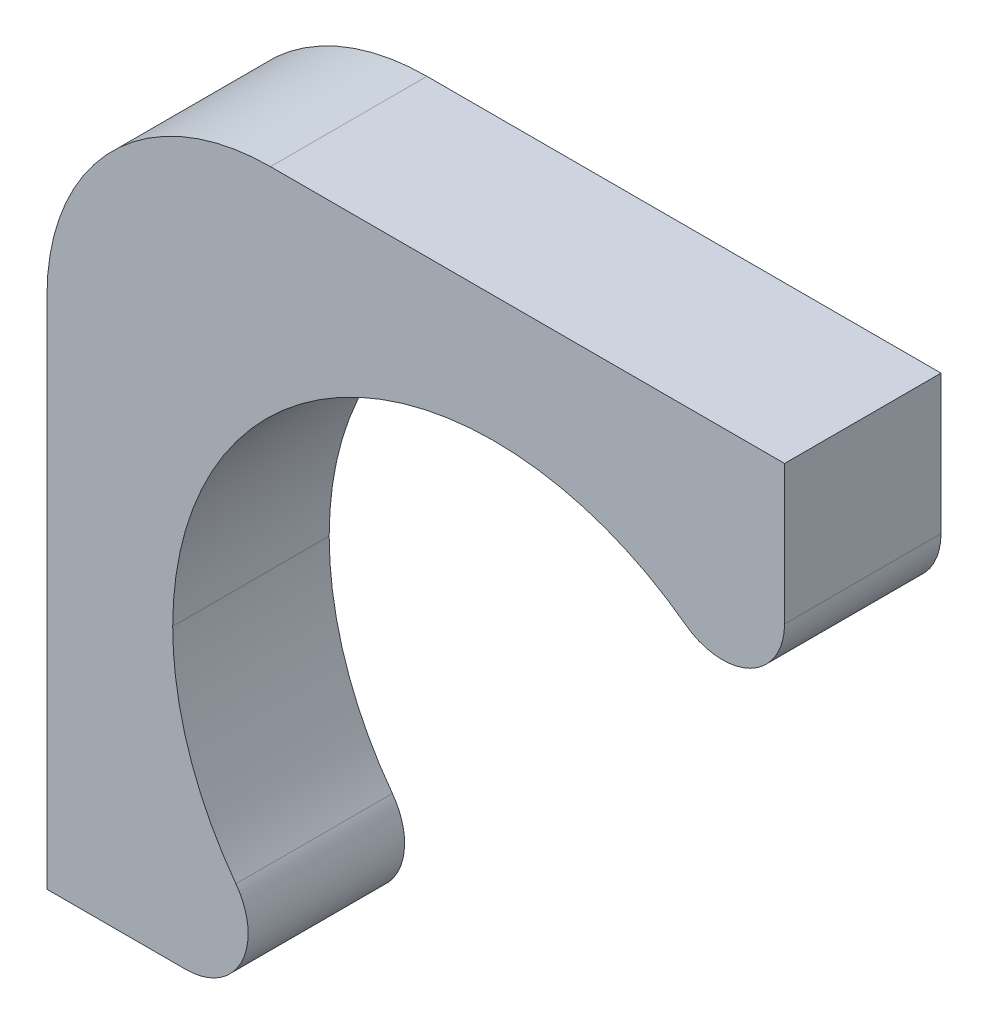
ISO-10303-21;
HEADER;
FILE_DESCRIPTION(('STEP AP214'),'2;1');
FILE_NAME('part.step','',(''),(''),'','','');
FILE_SCHEMA(('AUTOMOTIVE_DESIGN { 1 0 10303 214 1 1 1 1 }'));
ENDSEC;
DATA;
#1=APPLICATION_CONTEXT('core data for automotive mechanical design processes');
#2=APPLICATION_PROTOCOL_DEFINITION('international standard','automotive_design',2000,#1);
#3=PRODUCT_CONTEXT('',#1,'mechanical');
#4=PRODUCT('Part','Part','',(#3));
#5=PRODUCT_RELATED_PRODUCT_CATEGORY('part','',(#4));
#6=PRODUCT_DEFINITION_FORMATION('','',#4);
#7=PRODUCT_DEFINITION_CONTEXT('part definition',#1,'design');
#8=PRODUCT_DEFINITION('design','',#6,#7);
#9=PRODUCT_DEFINITION_SHAPE('','',#8);
#10=(LENGTH_UNIT() NAMED_UNIT(*) SI_UNIT(.MILLI.,.METRE.));
#11=(NAMED_UNIT(*) PLANE_ANGLE_UNIT() SI_UNIT($,.RADIAN.));
#12=(NAMED_UNIT(*) SI_UNIT($,.STERADIAN.) SOLID_ANGLE_UNIT());
#13=UNCERTAINTY_MEASURE_WITH_UNIT(LENGTH_MEASURE(1.E-05),#10,'distance_accuracy_value','');
#14=(GEOMETRIC_REPRESENTATION_CONTEXT(3) GLOBAL_UNCERTAINTY_ASSIGNED_CONTEXT((#13)) GLOBAL_UNIT_ASSIGNED_CONTEXT((#10,
#11,#12)) REPRESENTATION_CONTEXT('',''));
#15=CARTESIAN_POINT('',(0.,0.,0.));
#16=DIRECTION('',(0.,0.,1.));
#17=DIRECTION('',(1.,0.,0.));
#18=AXIS2_PLACEMENT_3D('',#15,#16,#17);
#19=CARTESIAN_POINT('',(-2.75631465594,-2.04368534406,0.));
#20=DIRECTION('',(0.,0.,1.));
#21=DIRECTION('',(1.,0.,0.));
#22=AXIS2_PLACEMENT_3D('',#19,#20,#21);
#23=PLANE('',#22);
#24=CARTESIAN_POINT('',(-2.75631465594,-2.04368534406,0.));
#25=DIRECTION('',(0.,0.,1.));
#26=DIRECTION('',(1.,0.,0.));
#27=AXIS2_PLACEMENT_3D('',#24,#25,#26);
#28=CIRCLE('',#27,0.556314655941);
#29=CARTESIAN_POINT('',(-2.20000000062,-2.04368534406,0.));
#30=VERTEX_POINT('',#29);
#31=CARTESIAN_POINT('',(-2.30943688582,-1.71234525276,0.));
#32=VERTEX_POINT('',#31);
#33=EDGE_CURVE('E162',#30,#32,#28,.T.);
#34=ORIENTED_EDGE('',*,*,#33,.F.);
#35=CARTESIAN_POINT('',(-2.75631465594,-2.04368534406,-3.72529914902109E-10));
#36=DIRECTION('',(0.,0.,1.));
#37=DIRECTION('',(0.,-1.,0.));
#38=AXIS2_PLACEMENT_3D('',#35,#36,#37);
#39=CIRCLE('',#38,0.556314655941);
#40=CARTESIAN_POINT('',(-2.75631465594,-2.60000000057,0.));
#41=VERTEX_POINT('',#40);
#42=EDGE_CURVE('E116',#41,#30,#39,.T.);
#43=ORIENTED_EDGE('',*,*,#42,.F.);
#44=DIRECTION('',(1.,0.,0.));
#45=VECTOR('',#44,1.);
#46=CARTESIAN_POINT('',(-3.37815732788,-2.6,-3.72529118664E-10));
#47=LINE('',#46,#45);
#48=CARTESIAN_POINT('',(-4.,-2.59999999963,-3.72529118664E-10));
#49=VERTEX_POINT('',#48);
#50=EDGE_CURVE('E208',#49,#41,#47,.T.);
#51=ORIENTED_EDGE('',*,*,#50,.F.);
#52=DIRECTION('',(0.,-1.,0.));
#53=VECTOR('',#52,1.);
#54=CARTESIAN_POINT('',(-4.,-0.299999999814,-3.72529118664E-10));
#55=LINE('',#54,#53);
#56=CARTESIAN_POINT('',(-4.,2.,-3.72529118664E-10));
#57=VERTEX_POINT('',#56);
#58=EDGE_CURVE('E129',#57,#49,#55,.T.);
#59=ORIENTED_EDGE('',*,*,#58,.F.);
#60=CARTESIAN_POINT('',(-2.,2.,-3.72529118664E-10));
#61=DIRECTION('',(0.,0.,1.));
#62=DIRECTION('',(1.,0.,0.));
#63=AXIS2_PLACEMENT_3D('',#60,#61,#62);
#64=CIRCLE('',#63,2.);
#65=CARTESIAN_POINT('',(-1.99999999963,4.,-3.72529118664E-10));
#66=VERTEX_POINT('',#65);
#67=EDGE_CURVE('E120',#66,#57,#64,.T.);
#68=ORIENTED_EDGE('',*,*,#67,.F.);
#69=DIRECTION('',(-1.,0.,0.));
#70=VECTOR('',#69,1.);
#71=CARTESIAN_POINT('',(0.300000000186,4.,-3.72529118664E-10));
#72=LINE('',#71,#70);
#73=CARTESIAN_POINT('',(2.6,4.,-3.72529118664E-10));
#74=VERTEX_POINT('',#73);
#75=EDGE_CURVE('E106',#74,#66,#72,.T.);
#76=ORIENTED_EDGE('',*,*,#75,.F.);
#77=DIRECTION('',(0.,1.,0.));
#78=VECTOR('',#77,1.);
#79=CARTESIAN_POINT('',(2.6,3.37815732788,-3.72529118664E-10));
#80=LINE('',#79,#78);
#81=CARTESIAN_POINT('',(2.59999999945,2.75631465669,0.));
#82=VERTEX_POINT('',#81);
#83=EDGE_CURVE('E96',#82,#74,#80,.T.);
#84=ORIENTED_EDGE('',*,*,#83,.F.);
#85=CARTESIAN_POINT('',(2.04368534406,2.75631465594,-3.72529914902109E-10));
#86=DIRECTION('',(0.,0.,1.));
#87=DIRECTION('',(-0.595598349027393,-0.803282395322992,0.));
#88=AXIS2_PLACEMENT_3D('',#85,#86,#87);
#89=CIRCLE('',#88,0.556314655941);
#90=CARTESIAN_POINT('',(1.71234525344,2.30943688656,-3.72529118664E-10));
#91=VERTEX_POINT('',#90);
#92=EDGE_CURVE('E87',#91,#82,#89,.T.);
#93=ORIENTED_EDGE('',*,*,#92,.F.);
#94=CARTESIAN_POINT('',(0.,0.,-3.72529118664E-10));
#95=DIRECTION('',(0.,0.,-1.));
#96=DIRECTION('',(1.,0.,0.));
#97=AXIS2_PLACEMENT_3D('',#94,#95,#96);
#98=CIRCLE('',#97,2.875);
#99=CARTESIAN_POINT('',(-2.875,0.,-3.72529118664E-10));
#100=VERTEX_POINT('',#99);
#101=EDGE_CURVE('E311',#100,#91,#98,.T.);
#102=ORIENTED_EDGE('',*,*,#101,.F.);
#103=CARTESIAN_POINT('',(0.,0.,-3.72529118664E-10));
#104=DIRECTION('',(0.,0.,-1.));
#105=DIRECTION('',(1.,0.,0.));
#106=AXIS2_PLACEMENT_3D('',#103,#104,#105);
#107=CIRCLE('',#106,2.875);
#108=EDGE_CURVE('E11',#32,#100,#107,.T.);
#109=ORIENTED_EDGE('',*,*,#108,.F.);
#110=EDGE_LOOP('',(#34,#43,#51,#59,#68,#76,#84,#93,#102,#109));
#111=FACE_BOUND('',#110,.T.);
#112=ADVANCED_FACE('F17',(#111),#23,.F.);
#113=CARTESIAN_POINT('',(0.,0.,1.4));
#114=DIRECTION('',(0.,0.,-1.));
#115=DIRECTION('',(-1.,0.,0.));
#116=AXIS2_PLACEMENT_3D('',#113,#114,#115);
#117=CYLINDRICAL_SURFACE('',#116,2.875);
#118=DIRECTION('',(0.,0.,-1.));
#119=VECTOR('',#118,1.);
#120=CARTESIAN_POINT('',(-2.875,0.,1.40000000037));
#121=LINE('',#120,#119);
#122=CARTESIAN_POINT('',(-2.875,0.,1.4));
#123=VERTEX_POINT('',#122);
#124=EDGE_CURVE('E156',#123,#100,#121,.T.);
#125=ORIENTED_EDGE('',*,*,#124,.F.);
#126=CARTESIAN_POINT('',(-2.30943688582,-1.71234525276,1.4));
#127=CARTESIAN_POINT('',(-2.48423375655,-1.47659703544,1.4));
#128=CARTESIAN_POINT('',(-2.62894876564,-1.21854502221,1.4));
#129=CARTESIAN_POINT('',(-2.73978751086,-0.943286310535,1.4));
#130=CARTESIAN_POINT('',(-2.83289541122,-0.58539717655,1.4));
#131=CARTESIAN_POINT('',(-2.86797349989,-0.220063592055,1.4));
#132=CARTESIAN_POINT('',(-2.87266100848,-0.146692643978,1.4));
#133=CARTESIAN_POINT('',(-2.87500000018,-0.0733463071471,1.4));
#134=CARTESIAN_POINT('',(-2.87500000018,9.20388210091E-10,1.4));
#135=(BOUNDED_CURVE() B_SPLINE_CURVE(5,(#126,#127,#128,#129,#130,#131,#132,#133,#134),
.UNSPECIFIED.,.F.,.F.) B_SPLINE_CURVE_WITH_KNOTS((6,3,6),(0.,2.0752249033,2.5938616214),
.UNSPECIFIED.) CURVE() GEOMETRIC_REPRESENTATION_ITEM() RATIONAL_B_SPLINE_CURVE((1.,1.,1.,1.,1.,
1.,1.,1.,1.)) REPRESENTATION_ITEM(''));
#136=CARTESIAN_POINT('',(-2.30943688656,-1.71234525344,1.4));
#137=VERTEX_POINT('',#136);
#138=EDGE_CURVE('E144',#137,#123,#135,.T.);
#139=ORIENTED_EDGE('',*,*,#138,.F.);
#140=DIRECTION('',(0.,0.,-1.));
#141=VECTOR('',#140,1.);
#142=CARTESIAN_POINT('',(-2.30943688656,-1.71234525344,1.40000000037));
#143=LINE('',#142,#141);
#144=EDGE_CURVE('E28',#137,#32,#143,.T.);
#145=ORIENTED_EDGE('',*,*,#144,.T.);
#146=ORIENTED_EDGE('',*,*,#108,.T.);
#147=EDGE_LOOP('',(#125,#139,#145,#146));
#148=FACE_BOUND('',#147,.T.);
#149=ADVANCED_FACE('F178',(#148),#117,.F.);
#150=CARTESIAN_POINT('',(-2.75631465594,-2.04368534406,1.4));
#151=DIRECTION('',(0.,0.,-1.));
#152=DIRECTION('',(1.,0.,0.));
#153=AXIS2_PLACEMENT_3D('',#150,#151,#152);
#154=CYLINDRICAL_SURFACE('',#153,0.556314655941);
#155=CARTESIAN_POINT('',(-2.7563146589,-2.0436853423,1.4));
#156=DIRECTION('',(0.,0.,1.));
#157=DIRECTION('',(1.,0.,0.));
#158=AXIS2_PLACEMENT_3D('',#155,#156,#157);
#159=CIRCLE('',#158,0.556314658274);
#160=CARTESIAN_POINT('',(-2.75631465594,-2.6,1.4));
#161=VERTEX_POINT('',#160);
#162=CARTESIAN_POINT('',(-2.20000000062,-2.04368534406,1.4));
#163=VERTEX_POINT('',#162);
#164=EDGE_CURVE('E145',#161,#163,#159,.T.);
#165=ORIENTED_EDGE('',*,*,#164,.F.);
#166=DIRECTION('',(0.,0.,-1.));
#167=VECTOR('',#166,1.);
#168=CARTESIAN_POINT('',(-2.75631465577,-2.6,0.699999999814));
#169=LINE('',#168,#167);
#170=EDGE_CURVE('E200',#161,#41,#169,.T.);
#171=ORIENTED_EDGE('',*,*,#170,.T.);
#172=ORIENTED_EDGE('',*,*,#42,.T.);
#173=ORIENTED_EDGE('',*,*,#33,.T.);
#174=ORIENTED_EDGE('',*,*,#144,.F.);
#175=CARTESIAN_POINT('',(-2.7563146589,-2.0436853423,1.4));
#176=DIRECTION('',(0.,0.,1.));
#177=DIRECTION('',(1.,0.,0.));
#178=AXIS2_PLACEMENT_3D('',#175,#176,#177);
#179=CIRCLE('',#178,0.556314658274);
#180=EDGE_CURVE('E141',#163,#137,#179,.T.);
#181=ORIENTED_EDGE('',*,*,#180,.F.);
#182=EDGE_LOOP('',(#165,#171,#172,#173,#174,#181));
#183=FACE_BOUND('',#182,.T.);
#184=ADVANCED_FACE('F168',(#183),#154,.T.);
#185=CARTESIAN_POINT('',(2.6,4.,1.4));
#186=DIRECTION('',(0.,-1.,0.));
#187=DIRECTION('',(0.,0.,-1.));
#188=AXIS2_PLACEMENT_3D('',#185,#186,#187);
#189=PLANE('',#188);
#190=ORIENTED_EDGE('',*,*,#75,.T.);
#191=DIRECTION('',(0.,0.,-1.));
#192=VECTOR('',#191,1.);
#193=CARTESIAN_POINT('',(-2.,4.,1.40000000037));
#194=LINE('',#193,#192);
#195=CARTESIAN_POINT('',(-1.99999999963,4.,1.4));
#196=VERTEX_POINT('',#195);
#197=EDGE_CURVE('E110',#196,#66,#194,.T.);
#198=ORIENTED_EDGE('',*,*,#197,.F.);
#199=DIRECTION('',(-1.,0.,0.));
#200=VECTOR('',#199,1.);
#201=CARTESIAN_POINT('',(0.299999999638,4.00000000092,1.4));
#202=LINE('',#201,#200);
#203=CARTESIAN_POINT('',(2.6,4.,1.4));
#204=VERTEX_POINT('',#203);
#205=EDGE_CURVE('E151',#204,#196,#202,.T.);
#206=ORIENTED_EDGE('',*,*,#205,.F.);
#207=DIRECTION('',(0.,0.,-1.));
#208=VECTOR('',#207,1.);
#209=CARTESIAN_POINT('',(2.6,4.,0.699999999814));
#210=LINE('',#209,#208);
#211=EDGE_CURVE('E113',#204,#74,#210,.T.);
#212=ORIENTED_EDGE('',*,*,#211,.T.);
#213=EDGE_LOOP('',(#190,#198,#206,#212));
#214=FACE_BOUND('',#213,.T.);
#215=ADVANCED_FACE('F108',(#214),#189,.F.);
#216=CARTESIAN_POINT('',(-2.,2.,1.4));
#217=DIRECTION('',(0.,0.,-1.));
#218=DIRECTION('',(-1.,0.,0.));
#219=AXIS2_PLACEMENT_3D('',#216,#217,#218);
#220=CYLINDRICAL_SURFACE('',#219,2.);
#221=ORIENTED_EDGE('',*,*,#67,.T.);
#222=DIRECTION('',(0.,0.,-1.));
#223=VECTOR('',#222,1.);
#224=CARTESIAN_POINT('',(-4.,2.,0.699999999814));
#225=LINE('',#224,#223);
#226=CARTESIAN_POINT('',(-4.,2.,1.4));
#227=VERTEX_POINT('',#226);
#228=EDGE_CURVE('E131',#227,#57,#225,.T.);
#229=ORIENTED_EDGE('',*,*,#228,.F.);
#230=CARTESIAN_POINT('',(-1.99999999703,1.99999999778,1.4));
#231=DIRECTION('',(0.,0.,1.));
#232=DIRECTION('',(1.,0.,0.));
#233=AXIS2_PLACEMENT_3D('',#230,#231,#232);
#234=CIRCLE('',#233,2.00000000314);
#235=EDGE_CURVE('E123',#196,#227,#234,.T.);
#236=ORIENTED_EDGE('',*,*,#235,.F.);
#237=ORIENTED_EDGE('',*,*,#197,.T.);
#238=EDGE_LOOP('',(#221,#229,#236,#237));
#239=FACE_BOUND('',#238,.T.);
#240=ADVANCED_FACE('F119',(#239),#220,.T.);
#241=CARTESIAN_POINT('',(-4.,2.,1.4));
#242=DIRECTION('',(1.,0.,0.));
#243=DIRECTION('',(0.,1.,0.));
#244=AXIS2_PLACEMENT_3D('',#241,#242,#243);
#245=PLANE('',#244);
#246=ORIENTED_EDGE('',*,*,#58,.T.);
#247=DIRECTION('',(0.,0.,-1.));
#248=VECTOR('',#247,1.);
#249=CARTESIAN_POINT('',(-4.,-2.6,0.699999999814));
#250=LINE('',#249,#248);
#251=CARTESIAN_POINT('',(-4.,-2.59999999963,1.4));
#252=VERTEX_POINT('',#251);
#253=EDGE_CURVE('E140',#252,#49,#250,.T.);
#254=ORIENTED_EDGE('',*,*,#253,.F.);
#255=DIRECTION('',(0.,-1.,0.));
#256=VECTOR('',#255,1.);
#257=CARTESIAN_POINT('',(-4.00000000018,-0.299999999825,1.4));
#258=LINE('',#257,#256);
#259=EDGE_CURVE('E150',#227,#252,#258,.T.);
#260=ORIENTED_EDGE('',*,*,#259,.F.);
#261=ORIENTED_EDGE('',*,*,#228,.T.);
#262=EDGE_LOOP('',(#246,#254,#260,#261));
#263=FACE_BOUND('',#262,.T.);
#264=ADVANCED_FACE('F179',(#263),#245,.F.);
#265=CARTESIAN_POINT('',(-4.,-2.6,1.4));
#266=DIRECTION('',(0.,1.,0.));
#267=DIRECTION('',(1.,0.,0.));
#268=AXIS2_PLACEMENT_3D('',#265,#266,#267);
#269=PLANE('',#268);
#270=ORIENTED_EDGE('',*,*,#50,.T.);
#271=ORIENTED_EDGE('',*,*,#170,.F.);
#272=DIRECTION('',(1.,0.,0.));
#273=VECTOR('',#272,1.);
#274=CARTESIAN_POINT('',(-3.37815732806,-2.60000000057,1.4));
#275=LINE('',#274,#273);
#276=EDGE_CURVE('E304',#252,#161,#275,.T.);
#277=ORIENTED_EDGE('',*,*,#276,.F.);
#278=ORIENTED_EDGE('',*,*,#253,.T.);
#279=EDGE_LOOP('',(#270,#271,#277,#278));
#280=FACE_BOUND('',#279,.T.);
#281=ADVANCED_FACE('F234',(#280),#269,.F.);
#282=CARTESIAN_POINT('',(2.6,4.,1.4));
#283=DIRECTION('',(-1.,0.,0.));
#284=DIRECTION('',(0.,0.,1.));
#285=AXIS2_PLACEMENT_3D('',#282,#283,#284);
#286=PLANE('',#285);
#287=ORIENTED_EDGE('',*,*,#83,.T.);
#288=ORIENTED_EDGE('',*,*,#211,.F.);
#289=DIRECTION('',(0.,1.,0.));
#290=VECTOR('',#289,1.);
#291=CARTESIAN_POINT('',(2.59999999945,3.3781573288,1.4));
#292=LINE('',#291,#290);
#293=CARTESIAN_POINT('',(2.6,2.75631465594,1.4));
#294=VERTEX_POINT('',#293);
#295=EDGE_CURVE('E291',#294,#204,#292,.T.);
#296=ORIENTED_EDGE('',*,*,#295,.F.);
#297=DIRECTION('',(0.,0.,-1.));
#298=VECTOR('',#297,1.);
#299=CARTESIAN_POINT('',(2.6,2.75631465594,1.40000000037));
#300=LINE('',#299,#298);
#301=EDGE_CURVE('E314',#294,#82,#300,.T.);
#302=ORIENTED_EDGE('',*,*,#301,.T.);
#303=EDGE_LOOP('',(#287,#288,#296,#302));
#304=FACE_BOUND('',#303,.T.);
#305=ADVANCED_FACE('F236',(#304),#286,.F.);
#306=CARTESIAN_POINT('',(-2.75631465594,-2.04368534406,1.4));
#307=DIRECTION('',(0.,0.,1.));
#308=DIRECTION('',(1.,0.,0.));
#309=AXIS2_PLACEMENT_3D('',#306,#307,#308);
#310=PLANE('',#309);
#311=ORIENTED_EDGE('',*,*,#164,.T.);
#312=ORIENTED_EDGE('',*,*,#180,.T.);
#313=ORIENTED_EDGE('',*,*,#138,.T.);
#314=CARTESIAN_POINT('',(0.,0.,1.4));
#315=DIRECTION('',(0.,0.,-1.));
#316=DIRECTION('',(1.,0.,0.));
#317=AXIS2_PLACEMENT_3D('',#314,#315,#316);
#318=CIRCLE('',#317,2.875);
#319=CARTESIAN_POINT('',(1.71234525344,2.30943688656,1.4));
#320=VERTEX_POINT('',#319);
#321=EDGE_CURVE('E152',#123,#320,#318,.T.);
#322=ORIENTED_EDGE('',*,*,#321,.T.);
#323=CARTESIAN_POINT('',(2.04368534406,2.75631465594,1.4));
#324=DIRECTION('',(0.,0.,1.));
#325=DIRECTION('',(1.,0.,0.));
#326=AXIS2_PLACEMENT_3D('',#323,#324,#325);
#327=CIRCLE('',#326,0.556314655941);
#328=EDGE_CURVE('E273',#320,#294,#327,.T.);
#329=ORIENTED_EDGE('',*,*,#328,.T.);
#330=ORIENTED_EDGE('',*,*,#295,.T.);
#331=ORIENTED_EDGE('',*,*,#205,.T.);
#332=ORIENTED_EDGE('',*,*,#235,.T.);
#333=ORIENTED_EDGE('',*,*,#259,.T.);
#334=ORIENTED_EDGE('',*,*,#276,.T.);
#335=EDGE_LOOP('',(#311,#312,#313,#322,#329,#330,#331,#332,#333,#334));
#336=FACE_BOUND('',#335,.T.);
#337=ADVANCED_FACE('F233',(#336),#310,.T.);
#338=CARTESIAN_POINT('',(2.04368534406,2.75631465594,1.4));
#339=DIRECTION('',(0.,0.,-1.));
#340=DIRECTION('',(1.,0.,0.));
#341=AXIS2_PLACEMENT_3D('',#338,#339,#340);
#342=CYLINDRICAL_SURFACE('',#341,0.556314655941);
#343=ORIENTED_EDGE('',*,*,#92,.T.);
#344=ORIENTED_EDGE('',*,*,#301,.F.);
#345=ORIENTED_EDGE('',*,*,#328,.F.);
#346=DIRECTION('',(0.,0.,-1.));
#347=VECTOR('',#346,1.);
#348=CARTESIAN_POINT('',(1.71234525344,2.30943688656,1.40000000037));
#349=LINE('',#348,#347);
#350=EDGE_CURVE('E266',#320,#91,#349,.T.);
#351=ORIENTED_EDGE('',*,*,#350,.T.);
#352=EDGE_LOOP('',(#343,#344,#345,#351));
#353=FACE_BOUND('',#352,.T.);
#354=ADVANCED_FACE('F223',(#353),#342,.T.);
#355=CARTESIAN_POINT('',(0.,0.,1.4));
#356=DIRECTION('',(0.,0.,-1.));
#357=DIRECTION('',(-1.,0.,0.));
#358=AXIS2_PLACEMENT_3D('',#355,#356,#357);
#359=CYLINDRICAL_SURFACE('',#358,2.875);
#360=ORIENTED_EDGE('',*,*,#321,.F.);
#361=ORIENTED_EDGE('',*,*,#124,.T.);
#362=ORIENTED_EDGE('',*,*,#101,.T.);
#363=ORIENTED_EDGE('',*,*,#350,.F.);
#364=EDGE_LOOP('',(#360,#361,#362,#363));
#365=FACE_BOUND('',#364,.T.);
#366=ADVANCED_FACE('F232',(#365),#359,.F.);
#367=CLOSED_SHELL('',(#112,#149,#184,#215,#240,#264,#281,#305,#337,#354,#366));
#368=MANIFOLD_SOLID_BREP('B1',#367);
#369=ADVANCED_BREP_SHAPE_REPRESENTATION('',(#18,#368),#14);
#370=SHAPE_DEFINITION_REPRESENTATION(#9,#369);
ENDSEC;
END-ISO-10303-21;
